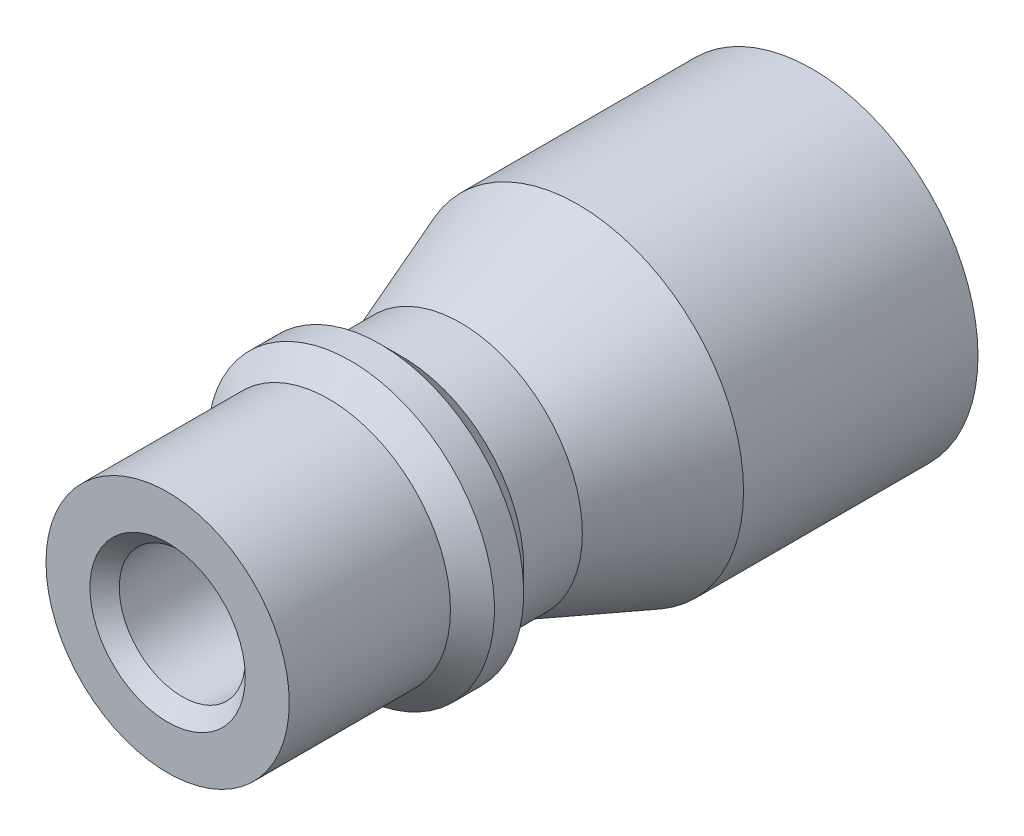
ISO-10303-21;
HEADER;
FILE_DESCRIPTION(('STEP AP214'),'2;1');
FILE_NAME('part.step','',(''),(''),'','','');
FILE_SCHEMA(('AUTOMOTIVE_DESIGN { 1 0 10303 214 1 1 1 1 }'));
ENDSEC;
DATA;
#1=APPLICATION_CONTEXT('core data for automotive mechanical design processes');
#2=APPLICATION_PROTOCOL_DEFINITION('international standard','automotive_design',2000,#1);
#3=PRODUCT_CONTEXT('',#1,'mechanical');
#4=PRODUCT('Part','Part','',(#3));
#5=PRODUCT_RELATED_PRODUCT_CATEGORY('part','',(#4));
#6=PRODUCT_DEFINITION_FORMATION('','',#4);
#7=PRODUCT_DEFINITION_CONTEXT('part definition',#1,'design');
#8=PRODUCT_DEFINITION('design','',#6,#7);
#9=PRODUCT_DEFINITION_SHAPE('','',#8);
#10=(LENGTH_UNIT() NAMED_UNIT(*) SI_UNIT(.MILLI.,.METRE.));
#11=(NAMED_UNIT(*) PLANE_ANGLE_UNIT() SI_UNIT($,.RADIAN.));
#12=(NAMED_UNIT(*) SI_UNIT($,.STERADIAN.) SOLID_ANGLE_UNIT());
#13=UNCERTAINTY_MEASURE_WITH_UNIT(LENGTH_MEASURE(1.E-05),#10,'distance_accuracy_value','');
#14=(GEOMETRIC_REPRESENTATION_CONTEXT(3) GLOBAL_UNCERTAINTY_ASSIGNED_CONTEXT((#13)) GLOBAL_UNIT_ASSIGNED_CONTEXT((#10,
#11,#12)) REPRESENTATION_CONTEXT('',''));
#15=CARTESIAN_POINT('',(0.,0.,0.));
#16=DIRECTION('',(0.,0.,1.));
#17=DIRECTION('',(1.,0.,0.));
#18=AXIS2_PLACEMENT_3D('',#15,#16,#17);
#19=CARTESIAN_POINT('',(0.,0.,22.));
#20=DIRECTION('',(0.,0.,-1.));
#21=DIRECTION('',(-1.,0.,0.));
#22=AXIS2_PLACEMENT_3D('',#19,#20,#21);
#23=CYLINDRICAL_SURFACE('',#22,4.15);
#24=CARTESIAN_POINT('',(0.,0.,14.));
#25=DIRECTION('',(0.,0.,-1.));
#26=DIRECTION('',(-1.,0.,0.));
#27=AXIS2_PLACEMENT_3D('',#24,#25,#26);
#28=CIRCLE('',#27,4.15);
#29=CARTESIAN_POINT('',(-4.15,0.,14.));
#30=VERTEX_POINT('',#29);
#31=EDGE_CURVE('E94',#30,#30,#28,.T.);
#32=ORIENTED_EDGE('',*,*,#31,.T.);
#33=EDGE_LOOP('',(#32));
#34=FACE_BOUND('',#33,.T.);
#35=CARTESIAN_POINT('',(0.,0.,12.));
#36=DIRECTION('',(0.,0.,1.));
#37=DIRECTION('',(1.,0.,0.));
#38=AXIS2_PLACEMENT_3D('',#35,#36,#37);
#39=CIRCLE('',#38,4.15);
#40=CARTESIAN_POINT('',(4.15,0.,12.));
#41=VERTEX_POINT('',#40);
#42=EDGE_CURVE('E56',#41,#41,#39,.T.);
#43=ORIENTED_EDGE('',*,*,#42,.T.);
#44=EDGE_LOOP('',(#43));
#45=FACE_BOUND('',#44,.T.);
#46=ADVANCED_FACE('F35',(#34,#45),#23,.T.);
#47=CARTESIAN_POINT('',(0.,0.,0.));
#48=DIRECTION('',(0.,0.,1.));
#49=DIRECTION('',(1.,0.,0.));
#50=AXIS2_PLACEMENT_3D('',#47,#48,#49);
#51=PLANE('',#50);
#52=CARTESIAN_POINT('',(0.,0.,0.));
#53=DIRECTION('',(0.,0.,1.));
#54=DIRECTION('',(1.,0.,0.));
#55=AXIS2_PLACEMENT_3D('',#52,#53,#54);
#56=CIRCLE('',#55,4.15);
#57=CARTESIAN_POINT('',(4.15,0.,0.));
#58=VERTEX_POINT('',#57);
#59=EDGE_CURVE('E50',#58,#58,#56,.T.);
#60=ORIENTED_EDGE('',*,*,#59,.T.);
#61=EDGE_LOOP('',(#60));
#62=FACE_BOUND('',#61,.T.);
#63=CARTESIAN_POINT('',(0.,0.,0.));
#64=DIRECTION('',(0.,0.,1.));
#65=DIRECTION('',(1.,0.,0.));
#66=AXIS2_PLACEMENT_3D('',#63,#64,#65);
#67=CIRCLE('',#66,5.65);
#68=CARTESIAN_POINT('',(5.65,0.,0.));
#69=VERTEX_POINT('',#68);
#70=EDGE_CURVE('E60',#69,#69,#67,.T.);
#71=ORIENTED_EDGE('',*,*,#70,.F.);
#72=EDGE_LOOP('',(#71));
#73=FACE_BOUND('',#72,.T.);
#74=ADVANCED_FACE('F126',(#62,#73),#51,.F.);
#75=CARTESIAN_POINT('',(0.,0.,8.));
#76=DIRECTION('',(0.,0.,-1.));
#77=DIRECTION('',(-1.,0.,0.));
#78=AXIS2_PLACEMENT_3D('',#75,#76,#77);
#79=CYLINDRICAL_SURFACE('',#78,5.65);
#80=CARTESIAN_POINT('',(0.,0.,8.));
#81=DIRECTION('',(0.,0.,-1.));
#82=DIRECTION('',(-1.,0.,0.));
#83=AXIS2_PLACEMENT_3D('',#80,#81,#82);
#84=CIRCLE('',#83,5.65);
#85=CARTESIAN_POINT('',(-5.65,0.,8.));
#86=VERTEX_POINT('',#85);
#87=EDGE_CURVE('E75',#86,#86,#84,.F.);
#88=ORIENTED_EDGE('',*,*,#87,.F.);
#89=EDGE_LOOP('',(#88));
#90=FACE_BOUND('',#89,.T.);
#91=ORIENTED_EDGE('',*,*,#70,.T.);
#92=EDGE_LOOP('',(#91));
#93=FACE_BOUND('',#92,.T.);
#94=ADVANCED_FACE('F131',(#90,#93),#79,.T.);
#95=CARTESIAN_POINT('',(0.,0.,8.));
#96=DIRECTION('',(0.,0.,-1.));
#97=DIRECTION('',(-1.,0.,0.));
#98=AXIS2_PLACEMENT_3D('',#95,#96,#97);
#99=CYLINDRICAL_SURFACE('',#98,3.65);
#100=CARTESIAN_POINT('',(0.,0.,0.5));
#101=DIRECTION('',(0.,0.,1.));
#102=DIRECTION('',(1.,0.,0.));
#103=AXIS2_PLACEMENT_3D('',#100,#101,#102);
#104=CIRCLE('',#103,3.65);
#105=CARTESIAN_POINT('',(3.65,0.,0.5));
#106=VERTEX_POINT('',#105);
#107=EDGE_CURVE('E46',#106,#106,#104,.F.);
#108=ORIENTED_EDGE('',*,*,#107,.T.);
#109=EDGE_LOOP('',(#108));
#110=FACE_BOUND('',#109,.T.);
#111=CARTESIAN_POINT('',(0.,0.,8.));
#112=DIRECTION('',(0.,0.,-1.));
#113=DIRECTION('',(-1.,0.,0.));
#114=AXIS2_PLACEMENT_3D('',#111,#112,#113);
#115=CIRCLE('',#114,3.65);
#116=CARTESIAN_POINT('',(-3.65,0.,8.));
#117=VERTEX_POINT('',#116);
#118=EDGE_CURVE('E88',#117,#117,#115,.T.);
#119=ORIENTED_EDGE('',*,*,#118,.F.);
#120=EDGE_LOOP('',(#119));
#121=FACE_BOUND('',#120,.T.);
#122=ADVANCED_FACE('F147',(#110,#121),#99,.F.);
#123=CARTESIAN_POINT('',(0.,0.,12.));
#124=DIRECTION('',(0.,0.,-1.));
#125=DIRECTION('',(-1.,0.,0.));
#126=AXIS2_PLACEMENT_3D('',#123,#124,#125);
#127=CONICAL_SURFACE('',#126,4.15,0.358770670270572);
#128=ORIENTED_EDGE('',*,*,#87,.T.);
#129=EDGE_LOOP('',(#128));
#130=FACE_BOUND('',#129,.T.);
#131=ORIENTED_EDGE('',*,*,#42,.F.);
#132=EDGE_LOOP('',(#131));
#133=FACE_BOUND('',#132,.T.);
#134=ADVANCED_FACE('F84',(#130,#133),#127,.T.);
#135=CARTESIAN_POINT('',(0.,0.,8.));
#136=DIRECTION('',(0.,0.,-1.));
#137=DIRECTION('',(-1.,0.,0.));
#138=AXIS2_PLACEMENT_3D('',#135,#136,#137);
#139=CONICAL_SURFACE('',#138,3.65,0.855211333477222);
#140=CARTESIAN_POINT('',(0.,0.,11.));
#141=DIRECTION('',(0.,0.,-1.));
#142=DIRECTION('',(-1.,0.,0.));
#143=AXIS2_PLACEMENT_3D('',#140,#141,#142);
#144=CIRCLE('',#143,0.198894778336966);
#145=CARTESIAN_POINT('',(-0.198894778336966,0.,11.));
#146=VERTEX_POINT('',#145);
#147=EDGE_CURVE('E61',#146,#146,#144,.T.);
#148=ORIENTED_EDGE('',*,*,#147,.F.);
#149=EDGE_LOOP('',(#148));
#150=FACE_BOUND('',#149,.T.);
#151=ORIENTED_EDGE('',*,*,#118,.T.);
#152=EDGE_LOOP('',(#151));
#153=FACE_BOUND('',#152,.T.);
#154=ADVANCED_FACE('F140',(#150,#153),#139,.F.);
#155=CARTESIAN_POINT('',(0.,0.,11.));
#156=DIRECTION('',(0.,0.,-1.));
#157=DIRECTION('',(-1.,0.,0.));
#158=AXIS2_PLACEMENT_3D('',#155,#156,#157);
#159=PLANE('',#158);
#160=ORIENTED_EDGE('',*,*,#147,.T.);
#161=EDGE_LOOP('',(#160));
#162=FACE_BOUND('',#161,.T.);
#163=ADVANCED_FACE('F136',(#162),#159,.T.);
#164=CARTESIAN_POINT('',(0.,0.,14.));
#165=DIRECTION('',(0.,0.,1.));
#166=DIRECTION('',(1.,0.,0.));
#167=AXIS2_PLACEMENT_3D('',#164,#165,#166);
#168=CONICAL_SURFACE('',#167,4.15,0.785398163397448);
#169=CARTESIAN_POINT('',(0.,0.,14.75));
#170=DIRECTION('',(0.,0.,-1.));
#171=DIRECTION('',(-1.,0.,0.));
#172=AXIS2_PLACEMENT_3D('',#169,#170,#171);
#173=CIRCLE('',#172,4.9);
#174=CARTESIAN_POINT('',(-4.9,0.,14.75));
#175=VERTEX_POINT('',#174);
#176=EDGE_CURVE('E97',#175,#175,#173,.T.);
#177=ORIENTED_EDGE('',*,*,#176,.T.);
#178=EDGE_LOOP('',(#177));
#179=FACE_BOUND('',#178,.T.);
#180=ORIENTED_EDGE('',*,*,#31,.F.);
#181=EDGE_LOOP('',(#180));
#182=FACE_BOUND('',#181,.T.);
#183=ADVANCED_FACE('F139',(#179,#182),#168,.T.);
#184=CARTESIAN_POINT('',(0.,0.,-80.9));
#185=DIRECTION('',(0.,0.,-1.));
#186=DIRECTION('',(-1.,0.,0.));
#187=AXIS2_PLACEMENT_3D('',#184,#185,#186);
#188=CYLINDRICAL_SURFACE('',#187,4.9);
#189=CARTESIAN_POINT('',(0.,0.,15.75));
#190=DIRECTION('',(0.,0.,-1.));
#191=DIRECTION('',(-1.,0.,0.));
#192=AXIS2_PLACEMENT_3D('',#189,#190,#191);
#193=CIRCLE('',#192,4.9);
#194=CARTESIAN_POINT('',(-4.9,0.,15.75));
#195=VERTEX_POINT('',#194);
#196=EDGE_CURVE('E100',#195,#195,#193,.T.);
#197=ORIENTED_EDGE('',*,*,#196,.T.);
#198=EDGE_LOOP('',(#197));
#199=FACE_BOUND('',#198,.T.);
#200=ORIENTED_EDGE('',*,*,#176,.F.);
#201=EDGE_LOOP('',(#200));
#202=FACE_BOUND('',#201,.T.);
#203=ADVANCED_FACE('F220',(#199,#202),#188,.T.);
#204=CARTESIAN_POINT('',(0.,0.,15.75));
#205=DIRECTION('',(0.,0.,-1.));
#206=DIRECTION('',(-1.,0.,0.));
#207=AXIS2_PLACEMENT_3D('',#204,#205,#206);
#208=CONICAL_SURFACE('',#207,4.9,0.785398163397448);
#209=CARTESIAN_POINT('',(0.,0.,16.5));
#210=DIRECTION('',(0.,0.,-1.));
#211=DIRECTION('',(-1.,0.,0.));
#212=AXIS2_PLACEMENT_3D('',#209,#210,#211);
#213=CIRCLE('',#212,4.15);
#214=CARTESIAN_POINT('',(-4.15,0.,16.5));
#215=VERTEX_POINT('',#214);
#216=EDGE_CURVE('E103',#215,#215,#213,.T.);
#217=ORIENTED_EDGE('',*,*,#216,.T.);
#218=EDGE_LOOP('',(#217));
#219=FACE_BOUND('',#218,.T.);
#220=ORIENTED_EDGE('',*,*,#196,.F.);
#221=EDGE_LOOP('',(#220));
#222=FACE_BOUND('',#221,.T.);
#223=ADVANCED_FACE('F107',(#219,#222),#208,.T.);
#224=CARTESIAN_POINT('',(0.,0.,12.));
#225=DIRECTION('',(0.,0.,1.));
#226=DIRECTION('',(1.,0.,0.));
#227=AXIS2_PLACEMENT_3D('',#224,#225,#226);
#228=PLANE('',#227);
#229=CARTESIAN_POINT('',(0.,0.,12.));
#230=DIRECTION('',(0.,0.,1.));
#231=DIRECTION('',(1.,0.,0.));
#232=AXIS2_PLACEMENT_3D('',#229,#230,#231);
#233=CIRCLE('',#232,2.15);
#234=CARTESIAN_POINT('',(2.15,0.,12.));
#235=VERTEX_POINT('',#234);
#236=EDGE_CURVE('E55',#235,#235,#233,.F.);
#237=ORIENTED_EDGE('',*,*,#236,.F.);
#238=EDGE_LOOP('',(#237));
#239=FACE_BOUND('',#238,.T.);
#240=ADVANCED_FACE('F123',(#239),#228,.T.);
#241=CARTESIAN_POINT('',(0.,0.,22.));
#242=DIRECTION('',(0.,0.,-1.));
#243=DIRECTION('',(-1.,0.,0.));
#244=AXIS2_PLACEMENT_3D('',#241,#242,#243);
#245=CYLINDRICAL_SURFACE('',#244,2.15);
#246=CARTESIAN_POINT('',(0.,0.,21.5));
#247=DIRECTION('',(0.,0.,1.));
#248=DIRECTION('',(1.,0.,0.));
#249=AXIS2_PLACEMENT_3D('',#246,#247,#248);
#250=CIRCLE('',#249,2.15);
#251=CARTESIAN_POINT('',(2.15,0.,21.5));
#252=VERTEX_POINT('',#251);
#253=EDGE_CURVE('E42',#252,#252,#250,.T.);
#254=ORIENTED_EDGE('',*,*,#253,.T.);
#255=EDGE_LOOP('',(#254));
#256=FACE_BOUND('',#255,.T.);
#257=ORIENTED_EDGE('',*,*,#236,.T.);
#258=EDGE_LOOP('',(#257));
#259=FACE_BOUND('',#258,.T.);
#260=ADVANCED_FACE('F118',(#256,#259),#245,.F.);
#261=CARTESIAN_POINT('',(0.,0.,22.));
#262=DIRECTION('',(0.,0.,1.));
#263=DIRECTION('',(1.,0.,0.));
#264=AXIS2_PLACEMENT_3D('',#261,#262,#263);
#265=PLANE('',#264);
#266=CARTESIAN_POINT('',(0.,0.,22.));
#267=DIRECTION('',(0.,0.,1.));
#268=DIRECTION('',(1.,0.,0.));
#269=AXIS2_PLACEMENT_3D('',#266,#267,#268);
#270=CIRCLE('',#269,2.65);
#271=CARTESIAN_POINT('',(2.65,0.,22.));
#272=VERTEX_POINT('',#271);
#273=EDGE_CURVE('E11',#272,#272,#270,.F.);
#274=ORIENTED_EDGE('',*,*,#273,.T.);
#275=EDGE_LOOP('',(#274));
#276=FACE_BOUND('',#275,.T.);
#277=CARTESIAN_POINT('',(0.,0.,22.));
#278=DIRECTION('',(0.,0.,1.));
#279=DIRECTION('',(1.,0.,0.));
#280=AXIS2_PLACEMENT_3D('',#277,#278,#279);
#281=CIRCLE('',#280,4.15);
#282=CARTESIAN_POINT('',(4.15,0.,22.));
#283=VERTEX_POINT('',#282);
#284=EDGE_CURVE('E91',#283,#283,#281,.T.);
#285=ORIENTED_EDGE('',*,*,#284,.T.);
#286=EDGE_LOOP('',(#285));
#287=FACE_BOUND('',#286,.T.);
#288=ADVANCED_FACE('F114',(#276,#287),#265,.T.);
#289=ORIENTED_EDGE('',*,*,#216,.F.);
#290=EDGE_LOOP('',(#289));
#291=FACE_BOUND('',#290,.T.);
#292=ORIENTED_EDGE('',*,*,#284,.F.);
#293=EDGE_LOOP('',(#292));
#294=FACE_BOUND('',#293,.T.);
#295=ADVANCED_FACE('F110',(#291,#294),#23,.T.);
#296=CARTESIAN_POINT('',(0.,0.,0.));
#297=DIRECTION('',(0.,0.,-1.));
#298=DIRECTION('',(-1.,0.,0.));
#299=AXIS2_PLACEMENT_3D('',#296,#297,#298);
#300=CONICAL_SURFACE('',#299,4.15,0.785398163397447);
#301=ORIENTED_EDGE('',*,*,#107,.F.);
#302=EDGE_LOOP('',(#301));
#303=FACE_BOUND('',#302,.T.);
#304=ORIENTED_EDGE('',*,*,#59,.F.);
#305=EDGE_LOOP('',(#304));
#306=FACE_BOUND('',#305,.T.);
#307=ADVANCED_FACE('F113',(#303,#306),#300,.F.);
#308=CARTESIAN_POINT('',(0.,0.,21.5));
#309=DIRECTION('',(0.,0.,1.));
#310=DIRECTION('',(1.,0.,0.));
#311=AXIS2_PLACEMENT_3D('',#308,#309,#310);
#312=CONICAL_SURFACE('',#311,2.15,0.785398163397454);
#313=ORIENTED_EDGE('',*,*,#273,.F.);
#314=EDGE_LOOP('',(#313));
#315=FACE_BOUND('',#314,.T.);
#316=ORIENTED_EDGE('',*,*,#253,.F.);
#317=EDGE_LOOP('',(#316));
#318=FACE_BOUND('',#317,.T.);
#319=ADVANCED_FACE('F37',(#315,#318),#312,.F.);
#320=CLOSED_SHELL('',(#46,#74,#94,#122,#134,#154,#163,#183,#203,#223,#240,#260,#288,#295,#307,#319));
#321=MANIFOLD_SOLID_BREP('B2',#320);
#322=ADVANCED_BREP_SHAPE_REPRESENTATION('',(#18,#321),#14);
#323=SHAPE_DEFINITION_REPRESENTATION(#9,#322);
ENDSEC;
END-ISO-10303-21;
